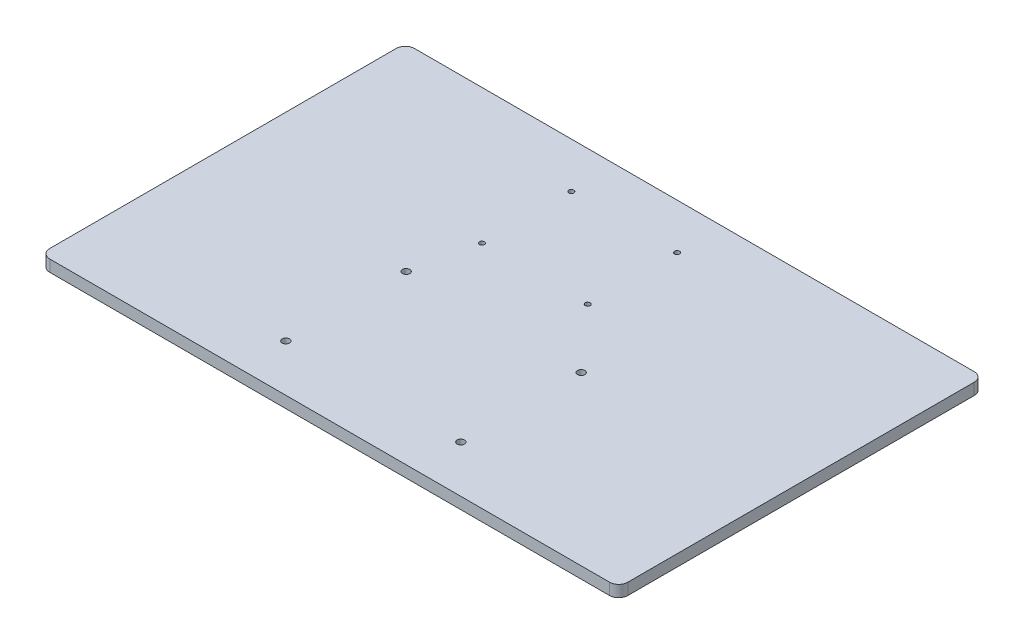
ISO-10303-21;
HEADER;
FILE_DESCRIPTION(('STEP AP214'),'2;1');
FILE_NAME('part.step','',(''),(''),'','','');
FILE_SCHEMA(('AUTOMOTIVE_DESIGN { 1 0 10303 214 1 1 1 1 }'));
ENDSEC;
DATA;
#1=APPLICATION_CONTEXT('core data for automotive mechanical design processes');
#2=APPLICATION_PROTOCOL_DEFINITION('international standard','automotive_design',2000,#1);
#3=PRODUCT_CONTEXT('',#1,'mechanical');
#4=PRODUCT('Part','Part','',(#3));
#5=PRODUCT_RELATED_PRODUCT_CATEGORY('part','',(#4));
#6=PRODUCT_DEFINITION_FORMATION('','',#4);
#7=PRODUCT_DEFINITION_CONTEXT('part definition',#1,'design');
#8=PRODUCT_DEFINITION('design','',#6,#7);
#9=PRODUCT_DEFINITION_SHAPE('','',#8);
#10=(LENGTH_UNIT() NAMED_UNIT(*) SI_UNIT(.MILLI.,.METRE.));
#11=(NAMED_UNIT(*) PLANE_ANGLE_UNIT() SI_UNIT($,.RADIAN.));
#12=(NAMED_UNIT(*) SI_UNIT($,.STERADIAN.) SOLID_ANGLE_UNIT());
#13=UNCERTAINTY_MEASURE_WITH_UNIT(LENGTH_MEASURE(1.E-05),#10,'distance_accuracy_value','');
#14=(GEOMETRIC_REPRESENTATION_CONTEXT(3) GLOBAL_UNCERTAINTY_ASSIGNED_CONTEXT((#13)) GLOBAL_UNIT_ASSIGNED_CONTEXT((#10,
#11,#12)) REPRESENTATION_CONTEXT('',''));
#15=CARTESIAN_POINT('',(0.,0.,0.));
#16=DIRECTION('',(0.,0.,1.));
#17=DIRECTION('',(1.,0.,0.));
#18=AXIS2_PLACEMENT_3D('',#15,#16,#17);
#19=CARTESIAN_POINT('',(158.5,-6.35,-100.));
#20=DIRECTION('',(1.,0.,0.));
#21=DIRECTION('',(0.,0.,-1.));
#22=AXIS2_PLACEMENT_3D('',#19,#20,#21);
#23=PLANE('',#22);
#24=DIRECTION('',(0.,0.,-1.));
#25=VECTOR('',#24,1.);
#26=CARTESIAN_POINT('',(158.5,0.,-100.));
#27=LINE('',#26,#25);
#28=CARTESIAN_POINT('',(158.5,0.,95.));
#29=VERTEX_POINT('',#28);
#30=CARTESIAN_POINT('',(158.5,0.,-95.));
#31=VERTEX_POINT('',#30);
#32=EDGE_CURVE('E158',#29,#31,#27,.T.);
#33=ORIENTED_EDGE('',*,*,#32,.F.);
#34=DIRECTION('',(0.,1.,0.));
#35=VECTOR('',#34,1.);
#36=CARTESIAN_POINT('',(158.5,-6.35,95.));
#37=LINE('',#36,#35);
#38=CARTESIAN_POINT('',(158.5,-6.35,95.));
#39=VERTEX_POINT('',#38);
#40=EDGE_CURVE('E147',#29,#39,#37,.F.);
#41=ORIENTED_EDGE('',*,*,#40,.T.);
#42=DIRECTION('',(0.,0.,-1.));
#43=VECTOR('',#42,1.);
#44=CARTESIAN_POINT('',(158.5,-6.35,-100.));
#45=LINE('',#44,#43);
#46=CARTESIAN_POINT('',(158.5,-6.35,-95.));
#47=VERTEX_POINT('',#46);
#48=EDGE_CURVE('E151',#39,#47,#45,.T.);
#49=ORIENTED_EDGE('',*,*,#48,.T.);
#50=DIRECTION('',(0.,1.,0.));
#51=VECTOR('',#50,1.);
#52=CARTESIAN_POINT('',(158.5,-6.35,-95.));
#53=LINE('',#52,#51);
#54=EDGE_CURVE('E144',#47,#31,#53,.T.);
#55=ORIENTED_EDGE('',*,*,#54,.T.);
#56=EDGE_LOOP('',(#33,#41,#49,#55));
#57=FACE_BOUND('',#56,.T.);
#58=ADVANCED_FACE('F34',(#57),#23,.T.);
#59=CARTESIAN_POINT('',(-158.5,-6.35,100.));
#60=DIRECTION('',(0.,0.,1.));
#61=DIRECTION('',(1.,0.,0.));
#62=AXIS2_PLACEMENT_3D('',#59,#60,#61);
#63=PLANE('',#62);
#64=DIRECTION('',(1.,0.,0.));
#65=VECTOR('',#64,1.);
#66=CARTESIAN_POINT('',(-158.5,0.,100.));
#67=LINE('',#66,#65);
#68=CARTESIAN_POINT('',(-153.5,0.,100.));
#69=VERTEX_POINT('',#68);
#70=CARTESIAN_POINT('',(153.5,0.,100.));
#71=VERTEX_POINT('',#70);
#72=EDGE_CURVE('E117',#69,#71,#67,.T.);
#73=ORIENTED_EDGE('',*,*,#72,.F.);
#74=DIRECTION('',(0.,1.,0.));
#75=VECTOR('',#74,1.);
#76=CARTESIAN_POINT('',(-153.5,-6.35,100.));
#77=LINE('',#76,#75);
#78=CARTESIAN_POINT('',(-153.5,-6.35,100.));
#79=VERTEX_POINT('',#78);
#80=EDGE_CURVE('E135',#69,#79,#77,.F.);
#81=ORIENTED_EDGE('',*,*,#80,.T.);
#82=DIRECTION('',(1.,0.,0.));
#83=VECTOR('',#82,1.);
#84=CARTESIAN_POINT('',(-158.5,-6.35,100.));
#85=LINE('',#84,#83);
#86=CARTESIAN_POINT('',(153.5,-6.35,100.));
#87=VERTEX_POINT('',#86);
#88=EDGE_CURVE('E119',#79,#87,#85,.T.);
#89=ORIENTED_EDGE('',*,*,#88,.T.);
#90=DIRECTION('',(0.,1.,0.));
#91=VECTOR('',#90,1.);
#92=CARTESIAN_POINT('',(153.5,-6.35,100.));
#93=LINE('',#92,#91);
#94=EDGE_CURVE('E132',#87,#71,#93,.T.);
#95=ORIENTED_EDGE('',*,*,#94,.T.);
#96=EDGE_LOOP('',(#73,#81,#89,#95));
#97=FACE_BOUND('',#96,.T.);
#98=ADVANCED_FACE('F247',(#97),#63,.T.);
#99=CARTESIAN_POINT('',(-158.5,-6.35,-100.));
#100=DIRECTION('',(-1.,0.,0.));
#101=DIRECTION('',(0.,0.,1.));
#102=AXIS2_PLACEMENT_3D('',#99,#100,#101);
#103=PLANE('',#102);
#104=DIRECTION('',(0.,0.,1.));
#105=VECTOR('',#104,1.);
#106=CARTESIAN_POINT('',(-158.5,-6.35,-100.));
#107=LINE('',#106,#105);
#108=CARTESIAN_POINT('',(-158.5,-6.35,-95.));
#109=VERTEX_POINT('',#108);
#110=CARTESIAN_POINT('',(-158.5,-6.35,95.));
#111=VERTEX_POINT('',#110);
#112=EDGE_CURVE('E123',#109,#111,#107,.T.);
#113=ORIENTED_EDGE('',*,*,#112,.T.);
#114=DIRECTION('',(0.,1.,0.));
#115=VECTOR('',#114,1.);
#116=CARTESIAN_POINT('',(-158.5,-6.35,95.));
#117=LINE('',#116,#115);
#118=CARTESIAN_POINT('',(-158.5,0.,95.));
#119=VERTEX_POINT('',#118);
#120=EDGE_CURVE('E109',#111,#119,#117,.T.);
#121=ORIENTED_EDGE('',*,*,#120,.T.);
#122=DIRECTION('',(0.,0.,1.));
#123=VECTOR('',#122,1.);
#124=CARTESIAN_POINT('',(-158.5,0.,-100.));
#125=LINE('',#124,#123);
#126=CARTESIAN_POINT('',(-158.5,0.,-95.));
#127=VERTEX_POINT('',#126);
#128=EDGE_CURVE('E102',#127,#119,#125,.T.);
#129=ORIENTED_EDGE('',*,*,#128,.F.);
#130=DIRECTION('',(0.,1.,0.));
#131=VECTOR('',#130,1.);
#132=CARTESIAN_POINT('',(-158.5,-6.35,-95.));
#133=LINE('',#132,#131);
#134=EDGE_CURVE('E115',#127,#109,#133,.F.);
#135=ORIENTED_EDGE('',*,*,#134,.T.);
#136=EDGE_LOOP('',(#113,#121,#129,#135));
#137=FACE_BOUND('',#136,.T.);
#138=ADVANCED_FACE('F114',(#137),#103,.T.);
#139=CARTESIAN_POINT('',(-158.5,-6.35,-100.));
#140=DIRECTION('',(0.,0.,-1.));
#141=DIRECTION('',(-1.,0.,0.));
#142=AXIS2_PLACEMENT_3D('',#139,#140,#141);
#143=PLANE('',#142);
#144=DIRECTION('',(-1.,0.,0.));
#145=VECTOR('',#144,1.);
#146=CARTESIAN_POINT('',(-158.5,0.,-100.));
#147=LINE('',#146,#145);
#148=CARTESIAN_POINT('',(153.5,0.,-100.));
#149=VERTEX_POINT('',#148);
#150=CARTESIAN_POINT('',(-153.5,0.,-100.));
#151=VERTEX_POINT('',#150);
#152=EDGE_CURVE('E103',#149,#151,#147,.T.);
#153=ORIENTED_EDGE('',*,*,#152,.F.);
#154=DIRECTION('',(0.,1.,0.));
#155=VECTOR('',#154,1.);
#156=CARTESIAN_POINT('',(153.5,-6.35,-100.));
#157=LINE('',#156,#155);
#158=CARTESIAN_POINT('',(153.5,-6.35,-100.));
#159=VERTEX_POINT('',#158);
#160=EDGE_CURVE('E11',#149,#159,#157,.F.);
#161=ORIENTED_EDGE('',*,*,#160,.T.);
#162=DIRECTION('',(-1.,0.,0.));
#163=VECTOR('',#162,1.);
#164=CARTESIAN_POINT('',(-158.5,-6.35,-100.));
#165=LINE('',#164,#163);
#166=CARTESIAN_POINT('',(-153.5,-6.35,-100.));
#167=VERTEX_POINT('',#166);
#168=EDGE_CURVE('E149',#159,#167,#165,.T.);
#169=ORIENTED_EDGE('',*,*,#168,.T.);
#170=DIRECTION('',(0.,1.,0.));
#171=VECTOR('',#170,1.);
#172=CARTESIAN_POINT('',(-153.5,-6.35,-100.));
#173=LINE('',#172,#171);
#174=EDGE_CURVE('E42',#167,#151,#173,.T.);
#175=ORIENTED_EDGE('',*,*,#174,.T.);
#176=EDGE_LOOP('',(#153,#161,#169,#175));
#177=FACE_BOUND('',#176,.T.);
#178=ADVANCED_FACE('F148',(#177),#143,.T.);
#179=CARTESIAN_POINT('',(0.,-6.35,0.));
#180=DIRECTION('',(0.,1.,0.));
#181=DIRECTION('',(0.,0.,1.));
#182=AXIS2_PLACEMENT_3D('',#179,#180,#181);
#183=PLANE('',#182);
#184=CARTESIAN_POINT('',(15.4853417142946,-6.35,-75.0318223737581));
#185=DIRECTION('',(0.,1.,0.));
#186=DIRECTION('',(0.,0.,1.));
#187=AXIS2_PLACEMENT_3D('',#184,#185,#186);
#188=CIRCLE('',#187,1.37499999999999);
#189=CARTESIAN_POINT('',(15.4853417142946,-6.35,-73.6568223737581));
#190=VERTEX_POINT('',#189);
#191=EDGE_CURVE('E161',#190,#190,#188,.T.);
#192=ORIENTED_EDGE('',*,*,#191,.T.);
#193=EDGE_LOOP('',(#192));
#194=FACE_BOUND('',#193,.T.);
#195=CARTESIAN_POINT('',(-49.8526210183535,-6.35,74.2010350791241));
#196=DIRECTION('',(0.,1.,0.));
#197=DIRECTION('',(0.,0.,1.));
#198=AXIS2_PLACEMENT_3D('',#195,#196,#197);
#199=CIRCLE('',#198,2.);
#200=CARTESIAN_POINT('',(-49.8526210183535,-6.35,76.2010350791241));
#201=VERTEX_POINT('',#200);
#202=EDGE_CURVE('E164',#201,#201,#199,.T.);
#203=ORIENTED_EDGE('',*,*,#202,.T.);
#204=EDGE_LOOP('',(#203));
#205=FACE_BOUND('',#204,.T.);
#206=CARTESIAN_POINT('',(-49.8526210183536,-6.35,8.20103507912406));
#207=DIRECTION('',(0.,1.,0.));
#208=DIRECTION('',(0.,0.,1.));
#209=AXIS2_PLACEMENT_3D('',#206,#207,#208);
#210=CIRCLE('',#209,2.);
#211=CARTESIAN_POINT('',(-49.8526210183536,-6.35,10.2010350791241));
#212=VERTEX_POINT('',#211);
#213=EDGE_CURVE('E168',#212,#212,#210,.T.);
#214=ORIENTED_EDGE('',*,*,#213,.T.);
#215=EDGE_LOOP('',(#214));
#216=FACE_BOUND('',#215,.T.);
#217=CARTESIAN_POINT('',(46.1473789816465,-6.35,74.201035079124));
#218=DIRECTION('',(0.,1.,0.));
#219=DIRECTION('',(0.,0.,1.));
#220=AXIS2_PLACEMENT_3D('',#217,#218,#219);
#221=CIRCLE('',#220,2.);
#222=CARTESIAN_POINT('',(46.1473789816465,-6.35,76.201035079124));
#223=VERTEX_POINT('',#222);
#224=EDGE_CURVE('E173',#223,#223,#221,.T.);
#225=ORIENTED_EDGE('',*,*,#224,.T.);
#226=EDGE_LOOP('',(#225));
#227=FACE_BOUND('',#226,.T.);
#228=CARTESIAN_POINT('',(15.4853417142937,-6.35,-26.0318223737581));
#229=DIRECTION('',(0.,1.,0.));
#230=DIRECTION('',(0.,0.,1.));
#231=AXIS2_PLACEMENT_3D('',#228,#229,#230);
#232=CIRCLE('',#231,1.37499999999999);
#233=CARTESIAN_POINT('',(15.4853417142937,-6.35,-24.6568223737581));
#234=VERTEX_POINT('',#233);
#235=EDGE_CURVE('E176',#234,#234,#232,.T.);
#236=ORIENTED_EDGE('',*,*,#235,.T.);
#237=EDGE_LOOP('',(#236));
#238=FACE_BOUND('',#237,.T.);
#239=CARTESIAN_POINT('',(-42.5146582857063,-6.35,-26.0318223737591));
#240=DIRECTION('',(0.,1.,0.));
#241=DIRECTION('',(0.,0.,1.));
#242=AXIS2_PLACEMENT_3D('',#239,#240,#241);
#243=CIRCLE('',#242,1.37499999999999);
#244=CARTESIAN_POINT('',(-42.5146582857063,-6.35,-24.6568223737591));
#245=VERTEX_POINT('',#244);
#246=EDGE_CURVE('E179',#245,#245,#243,.T.);
#247=ORIENTED_EDGE('',*,*,#246,.T.);
#248=EDGE_LOOP('',(#247));
#249=FACE_BOUND('',#248,.T.);
#250=CARTESIAN_POINT('',(-42.5146582857054,-6.35,-75.0318223737591));
#251=DIRECTION('',(0.,1.,0.));
#252=DIRECTION('',(0.,0.,1.));
#253=AXIS2_PLACEMENT_3D('',#250,#251,#252);
#254=CIRCLE('',#253,1.37500000000002);
#255=CARTESIAN_POINT('',(-42.5146582857054,-6.35,-73.656822373759));
#256=VERTEX_POINT('',#255);
#257=EDGE_CURVE('E182',#256,#256,#254,.T.);
#258=ORIENTED_EDGE('',*,*,#257,.T.);
#259=EDGE_LOOP('',(#258));
#260=FACE_BOUND('',#259,.T.);
#261=CARTESIAN_POINT('',(46.1473789816464,-6.35,8.20103507912398));
#262=DIRECTION('',(0.,1.,0.));
#263=DIRECTION('',(0.,0.,1.));
#264=AXIS2_PLACEMENT_3D('',#261,#262,#263);
#265=CIRCLE('',#264,2.);
#266=CARTESIAN_POINT('',(46.1473789816464,-6.35,10.201035079124));
#267=VERTEX_POINT('',#266);
#268=EDGE_CURVE('E185',#267,#267,#265,.T.);
#269=ORIENTED_EDGE('',*,*,#268,.T.);
#270=EDGE_LOOP('',(#269));
#271=FACE_BOUND('',#270,.T.);
#272=ORIENTED_EDGE('',*,*,#88,.F.);
#273=CARTESIAN_POINT('',(-153.5,-6.35,95.));
#274=DIRECTION('',(0.,1.,0.));
#275=DIRECTION('',(0.,0.,1.));
#276=AXIS2_PLACEMENT_3D('',#273,#274,#275);
#277=CIRCLE('',#276,5.);
#278=EDGE_CURVE('E142',#79,#111,#277,.F.);
#279=ORIENTED_EDGE('',*,*,#278,.T.);
#280=ORIENTED_EDGE('',*,*,#112,.F.);
#281=CARTESIAN_POINT('',(-153.5,-6.35,-95.));
#282=DIRECTION('',(0.,1.,0.));
#283=DIRECTION('',(0.,0.,1.));
#284=AXIS2_PLACEMENT_3D('',#281,#282,#283);
#285=CIRCLE('',#284,5.);
#286=EDGE_CURVE('E49',#109,#167,#285,.F.);
#287=ORIENTED_EDGE('',*,*,#286,.T.);
#288=ORIENTED_EDGE('',*,*,#168,.F.);
#289=CARTESIAN_POINT('',(153.5,-6.35,-95.));
#290=DIRECTION('',(0.,1.,0.));
#291=DIRECTION('',(0.,0.,1.));
#292=AXIS2_PLACEMENT_3D('',#289,#290,#291);
#293=CIRCLE('',#292,5.);
#294=EDGE_CURVE('E138',#159,#47,#293,.F.);
#295=ORIENTED_EDGE('',*,*,#294,.T.);
#296=ORIENTED_EDGE('',*,*,#48,.F.);
#297=CARTESIAN_POINT('',(153.5,-6.35,95.));
#298=DIRECTION('',(0.,1.,0.));
#299=DIRECTION('',(0.,0.,1.));
#300=AXIS2_PLACEMENT_3D('',#297,#298,#299);
#301=CIRCLE('',#300,5.);
#302=EDGE_CURVE('E140',#39,#87,#301,.F.);
#303=ORIENTED_EDGE('',*,*,#302,.T.);
#304=EDGE_LOOP('',(#272,#279,#280,#287,#288,#295,#296,#303));
#305=FACE_BOUND('',#304,.T.);
#306=ADVANCED_FACE('F219',(#194,#205,#216,#227,#238,#249,#260,#271,#305),#183,.F.);
#307=CARTESIAN_POINT('',(0.,0.,0.));
#308=DIRECTION('',(0.,1.,0.));
#309=DIRECTION('',(0.,0.,1.));
#310=AXIS2_PLACEMENT_3D('',#307,#308,#309);
#311=PLANE('',#310);
#312=CARTESIAN_POINT('',(15.4853417142946,0.,-75.0318223737581));
#313=DIRECTION('',(0.,1.,0.));
#314=DIRECTION('',(0.,0.,1.));
#315=AXIS2_PLACEMENT_3D('',#312,#313,#314);
#316=CIRCLE('',#315,1.37499999999999);
#317=CARTESIAN_POINT('',(15.4853417142946,0.,-73.6568223737581));
#318=VERTEX_POINT('',#317);
#319=EDGE_CURVE('E198',#318,#318,#316,.T.);
#320=ORIENTED_EDGE('',*,*,#319,.F.);
#321=EDGE_LOOP('',(#320));
#322=FACE_BOUND('',#321,.T.);
#323=CARTESIAN_POINT('',(-49.8526210183535,0.,74.2010350791241));
#324=DIRECTION('',(0.,1.,0.));
#325=DIRECTION('',(0.,0.,1.));
#326=AXIS2_PLACEMENT_3D('',#323,#324,#325);
#327=CIRCLE('',#326,2.);
#328=CARTESIAN_POINT('',(-49.8526210183535,0.,76.2010350791241));
#329=VERTEX_POINT('',#328);
#330=EDGE_CURVE('E195',#329,#329,#327,.T.);
#331=ORIENTED_EDGE('',*,*,#330,.F.);
#332=EDGE_LOOP('',(#331));
#333=FACE_BOUND('',#332,.T.);
#334=CARTESIAN_POINT('',(-49.8526210183536,0.,8.20103507912406));
#335=DIRECTION('',(0.,1.,0.));
#336=DIRECTION('',(0.,0.,1.));
#337=AXIS2_PLACEMENT_3D('',#334,#335,#336);
#338=CIRCLE('',#337,2.);
#339=CARTESIAN_POINT('',(-49.8526210183536,0.,10.2010350791241));
#340=VERTEX_POINT('',#339);
#341=EDGE_CURVE('E192',#340,#340,#338,.T.);
#342=ORIENTED_EDGE('',*,*,#341,.F.);
#343=EDGE_LOOP('',(#342));
#344=FACE_BOUND('',#343,.T.);
#345=CARTESIAN_POINT('',(46.1473789816465,0.,74.201035079124));
#346=DIRECTION('',(0.,1.,0.));
#347=DIRECTION('',(0.,0.,1.));
#348=AXIS2_PLACEMENT_3D('',#345,#346,#347);
#349=CIRCLE('',#348,2.);
#350=CARTESIAN_POINT('',(46.1473789816465,0.,76.201035079124));
#351=VERTEX_POINT('',#350);
#352=EDGE_CURVE('E191',#351,#351,#349,.T.);
#353=ORIENTED_EDGE('',*,*,#352,.F.);
#354=EDGE_LOOP('',(#353));
#355=FACE_BOUND('',#354,.T.);
#356=CARTESIAN_POINT('',(15.4853417142937,0.,-26.0318223737581));
#357=DIRECTION('',(0.,1.,0.));
#358=DIRECTION('',(0.,0.,1.));
#359=AXIS2_PLACEMENT_3D('',#356,#357,#358);
#360=CIRCLE('',#359,1.37499999999999);
#361=CARTESIAN_POINT('',(15.4853417142937,0.,-24.6568223737581));
#362=VERTEX_POINT('',#361);
#363=EDGE_CURVE('E201',#362,#362,#360,.T.);
#364=ORIENTED_EDGE('',*,*,#363,.F.);
#365=EDGE_LOOP('',(#364));
#366=FACE_BOUND('',#365,.T.);
#367=CARTESIAN_POINT('',(-42.5146582857063,0.,-26.0318223737591));
#368=DIRECTION('',(0.,1.,0.));
#369=DIRECTION('',(0.,0.,1.));
#370=AXIS2_PLACEMENT_3D('',#367,#368,#369);
#371=CIRCLE('',#370,1.37499999999999);
#372=CARTESIAN_POINT('',(-42.5146582857063,0.,-24.6568223737591));
#373=VERTEX_POINT('',#372);
#374=EDGE_CURVE('E207',#373,#373,#371,.T.);
#375=ORIENTED_EDGE('',*,*,#374,.F.);
#376=EDGE_LOOP('',(#375));
#377=FACE_BOUND('',#376,.T.);
#378=CARTESIAN_POINT('',(-42.5146582857054,0.,-75.0318223737591));
#379=DIRECTION('',(0.,1.,0.));
#380=DIRECTION('',(0.,0.,1.));
#381=AXIS2_PLACEMENT_3D('',#378,#379,#380);
#382=CIRCLE('',#381,1.37500000000002);
#383=CARTESIAN_POINT('',(-42.5146582857054,0.,-73.656822373759));
#384=VERTEX_POINT('',#383);
#385=EDGE_CURVE('E204',#384,#384,#382,.T.);
#386=ORIENTED_EDGE('',*,*,#385,.F.);
#387=EDGE_LOOP('',(#386));
#388=FACE_BOUND('',#387,.T.);
#389=CARTESIAN_POINT('',(46.1473789816464,0.,8.20103507912398));
#390=DIRECTION('',(0.,1.,0.));
#391=DIRECTION('',(0.,0.,1.));
#392=AXIS2_PLACEMENT_3D('',#389,#390,#391);
#393=CIRCLE('',#392,2.);
#394=CARTESIAN_POINT('',(46.1473789816464,0.,10.201035079124));
#395=VERTEX_POINT('',#394);
#396=EDGE_CURVE('E188',#395,#395,#393,.T.);
#397=ORIENTED_EDGE('',*,*,#396,.F.);
#398=EDGE_LOOP('',(#397));
#399=FACE_BOUND('',#398,.T.);
#400=ORIENTED_EDGE('',*,*,#128,.T.);
#401=CARTESIAN_POINT('',(-153.5,0.,95.));
#402=DIRECTION('',(0.,1.,0.));
#403=DIRECTION('',(0.,0.,1.));
#404=AXIS2_PLACEMENT_3D('',#401,#402,#403);
#405=CIRCLE('',#404,5.);
#406=EDGE_CURVE('E130',#119,#69,#405,.T.);
#407=ORIENTED_EDGE('',*,*,#406,.T.);
#408=ORIENTED_EDGE('',*,*,#72,.T.);
#409=CARTESIAN_POINT('',(153.5,0.,95.));
#410=DIRECTION('',(0.,1.,0.));
#411=DIRECTION('',(0.,0.,1.));
#412=AXIS2_PLACEMENT_3D('',#409,#410,#411);
#413=CIRCLE('',#412,5.);
#414=EDGE_CURVE('E128',#71,#29,#413,.T.);
#415=ORIENTED_EDGE('',*,*,#414,.T.);
#416=ORIENTED_EDGE('',*,*,#32,.T.);
#417=CARTESIAN_POINT('',(153.5,0.,-95.));
#418=DIRECTION('',(0.,1.,0.));
#419=DIRECTION('',(0.,0.,1.));
#420=AXIS2_PLACEMENT_3D('',#417,#418,#419);
#421=CIRCLE('',#420,5.);
#422=EDGE_CURVE('E108',#31,#149,#421,.T.);
#423=ORIENTED_EDGE('',*,*,#422,.T.);
#424=ORIENTED_EDGE('',*,*,#152,.T.);
#425=CARTESIAN_POINT('',(-153.5,0.,-95.));
#426=DIRECTION('',(0.,1.,0.));
#427=DIRECTION('',(0.,0.,1.));
#428=AXIS2_PLACEMENT_3D('',#425,#426,#427);
#429=CIRCLE('',#428,5.);
#430=EDGE_CURVE('E99',#151,#127,#429,.T.);
#431=ORIENTED_EDGE('',*,*,#430,.T.);
#432=EDGE_LOOP('',(#400,#407,#408,#415,#416,#423,#424,#431));
#433=FACE_BOUND('',#432,.T.);
#434=ADVANCED_FACE('F101',(#322,#333,#344,#355,#366,#377,#388,#399,#433),#311,.T.);
#435=CARTESIAN_POINT('',(-153.5,-6.35,95.));
#436=DIRECTION('',(0.,1.,0.));
#437=DIRECTION('',(0.,0.,1.));
#438=AXIS2_PLACEMENT_3D('',#435,#436,#437);
#439=CYLINDRICAL_SURFACE('',#438,5.);
#440=ORIENTED_EDGE('',*,*,#278,.F.);
#441=ORIENTED_EDGE('',*,*,#80,.F.);
#442=ORIENTED_EDGE('',*,*,#406,.F.);
#443=ORIENTED_EDGE('',*,*,#120,.F.);
#444=EDGE_LOOP('',(#440,#441,#442,#443));
#445=FACE_BOUND('',#444,.T.);
#446=ADVANCED_FACE('F218',(#445),#439,.T.);
#447=CARTESIAN_POINT('',(153.5,-6.35,95.));
#448=DIRECTION('',(0.,1.,0.));
#449=DIRECTION('',(0.,0.,1.));
#450=AXIS2_PLACEMENT_3D('',#447,#448,#449);
#451=CYLINDRICAL_SURFACE('',#450,5.);
#452=ORIENTED_EDGE('',*,*,#302,.F.);
#453=ORIENTED_EDGE('',*,*,#40,.F.);
#454=ORIENTED_EDGE('',*,*,#414,.F.);
#455=ORIENTED_EDGE('',*,*,#94,.F.);
#456=EDGE_LOOP('',(#452,#453,#454,#455));
#457=FACE_BOUND('',#456,.T.);
#458=ADVANCED_FACE('F249',(#457),#451,.T.);
#459=CARTESIAN_POINT('',(153.5,-6.35,-95.));
#460=DIRECTION('',(0.,1.,0.));
#461=DIRECTION('',(0.,0.,1.));
#462=AXIS2_PLACEMENT_3D('',#459,#460,#461);
#463=CYLINDRICAL_SURFACE('',#462,5.);
#464=ORIENTED_EDGE('',*,*,#294,.F.);
#465=ORIENTED_EDGE('',*,*,#160,.F.);
#466=ORIENTED_EDGE('',*,*,#422,.F.);
#467=ORIENTED_EDGE('',*,*,#54,.F.);
#468=EDGE_LOOP('',(#464,#465,#466,#467));
#469=FACE_BOUND('',#468,.T.);
#470=ADVANCED_FACE('F254',(#469),#463,.T.);
#471=CARTESIAN_POINT('',(-153.5,-6.35,-95.));
#472=DIRECTION('',(0.,1.,0.));
#473=DIRECTION('',(0.,0.,1.));
#474=AXIS2_PLACEMENT_3D('',#471,#472,#473);
#475=CYLINDRICAL_SURFACE('',#474,5.);
#476=ORIENTED_EDGE('',*,*,#286,.F.);
#477=ORIENTED_EDGE('',*,*,#134,.F.);
#478=ORIENTED_EDGE('',*,*,#430,.F.);
#479=ORIENTED_EDGE('',*,*,#174,.F.);
#480=EDGE_LOOP('',(#476,#477,#478,#479));
#481=FACE_BOUND('',#480,.T.);
#482=ADVANCED_FACE('F36',(#481),#475,.T.);
#483=CARTESIAN_POINT('',(46.1473789816464,-10.,8.20103507912398));
#484=DIRECTION('',(0.,1.,0.));
#485=DIRECTION('',(0.,0.,1.));
#486=AXIS2_PLACEMENT_3D('',#483,#484,#485);
#487=CYLINDRICAL_SURFACE('',#486,2.);
#488=ORIENTED_EDGE('',*,*,#396,.T.);
#489=EDGE_LOOP('',(#488));
#490=FACE_BOUND('',#489,.T.);
#491=ORIENTED_EDGE('',*,*,#268,.F.);
#492=EDGE_LOOP('',(#491));
#493=FACE_BOUND('',#492,.T.);
#494=ADVANCED_FACE('F228',(#490,#493),#487,.F.);
#495=CARTESIAN_POINT('',(-42.5146582857054,-10.,-75.0318223737591));
#496=DIRECTION('',(0.,1.,0.));
#497=DIRECTION('',(0.,0.,1.));
#498=AXIS2_PLACEMENT_3D('',#495,#496,#497);
#499=CYLINDRICAL_SURFACE('',#498,1.37500000000002);
#500=ORIENTED_EDGE('',*,*,#385,.T.);
#501=EDGE_LOOP('',(#500));
#502=FACE_BOUND('',#501,.T.);
#503=ORIENTED_EDGE('',*,*,#257,.F.);
#504=EDGE_LOOP('',(#503));
#505=FACE_BOUND('',#504,.T.);
#506=ADVANCED_FACE('F231',(#502,#505),#499,.F.);
#507=CARTESIAN_POINT('',(-42.5146582857063,-10.,-26.0318223737591));
#508=DIRECTION('',(0.,1.,0.));
#509=DIRECTION('',(0.,0.,1.));
#510=AXIS2_PLACEMENT_3D('',#507,#508,#509);
#511=CYLINDRICAL_SURFACE('',#510,1.37499999999999);
#512=ORIENTED_EDGE('',*,*,#374,.T.);
#513=EDGE_LOOP('',(#512));
#514=FACE_BOUND('',#513,.T.);
#515=ORIENTED_EDGE('',*,*,#246,.F.);
#516=EDGE_LOOP('',(#515));
#517=FACE_BOUND('',#516,.T.);
#518=ADVANCED_FACE('F317',(#514,#517),#511,.F.);
#519=CARTESIAN_POINT('',(15.4853417142937,-10.,-26.0318223737581));
#520=DIRECTION('',(0.,1.,0.));
#521=DIRECTION('',(0.,0.,1.));
#522=AXIS2_PLACEMENT_3D('',#519,#520,#521);
#523=CYLINDRICAL_SURFACE('',#522,1.37499999999999);
#524=ORIENTED_EDGE('',*,*,#363,.T.);
#525=EDGE_LOOP('',(#524));
#526=FACE_BOUND('',#525,.T.);
#527=ORIENTED_EDGE('',*,*,#235,.F.);
#528=EDGE_LOOP('',(#527));
#529=FACE_BOUND('',#528,.T.);
#530=ADVANCED_FACE('F213',(#526,#529),#523,.F.);
#531=CARTESIAN_POINT('',(46.1473789816465,-10.,74.201035079124));
#532=DIRECTION('',(0.,1.,0.));
#533=DIRECTION('',(0.,0.,1.));
#534=AXIS2_PLACEMENT_3D('',#531,#532,#533);
#535=CYLINDRICAL_SURFACE('',#534,2.);
#536=ORIENTED_EDGE('',*,*,#352,.T.);
#537=EDGE_LOOP('',(#536));
#538=FACE_BOUND('',#537,.T.);
#539=ORIENTED_EDGE('',*,*,#224,.F.);
#540=EDGE_LOOP('',(#539));
#541=FACE_BOUND('',#540,.T.);
#542=ADVANCED_FACE('F336',(#538,#541),#535,.F.);
#543=CARTESIAN_POINT('',(-49.8526210183536,-10.,8.20103507912406));
#544=DIRECTION('',(0.,1.,0.));
#545=DIRECTION('',(0.,0.,1.));
#546=AXIS2_PLACEMENT_3D('',#543,#544,#545);
#547=CYLINDRICAL_SURFACE('',#546,2.);
#548=ORIENTED_EDGE('',*,*,#341,.T.);
#549=EDGE_LOOP('',(#548));
#550=FACE_BOUND('',#549,.T.);
#551=ORIENTED_EDGE('',*,*,#213,.F.);
#552=EDGE_LOOP('',(#551));
#553=FACE_BOUND('',#552,.T.);
#554=ADVANCED_FACE('F345',(#550,#553),#547,.F.);
#555=CARTESIAN_POINT('',(-49.8526210183535,-10.,74.2010350791241));
#556=DIRECTION('',(0.,1.,0.));
#557=DIRECTION('',(0.,0.,1.));
#558=AXIS2_PLACEMENT_3D('',#555,#556,#557);
#559=CYLINDRICAL_SURFACE('',#558,2.);
#560=ORIENTED_EDGE('',*,*,#330,.T.);
#561=EDGE_LOOP('',(#560));
#562=FACE_BOUND('',#561,.T.);
#563=ORIENTED_EDGE('',*,*,#202,.F.);
#564=EDGE_LOOP('',(#563));
#565=FACE_BOUND('',#564,.T.);
#566=ADVANCED_FACE('F355',(#562,#565),#559,.F.);
#567=CARTESIAN_POINT('',(15.4853417142946,-10.,-75.0318223737581));
#568=DIRECTION('',(0.,1.,0.));
#569=DIRECTION('',(0.,0.,1.));
#570=AXIS2_PLACEMENT_3D('',#567,#568,#569);
#571=CYLINDRICAL_SURFACE('',#570,1.37499999999999);
#572=ORIENTED_EDGE('',*,*,#319,.T.);
#573=EDGE_LOOP('',(#572));
#574=FACE_BOUND('',#573,.T.);
#575=ORIENTED_EDGE('',*,*,#191,.F.);
#576=EDGE_LOOP('',(#575));
#577=FACE_BOUND('',#576,.T.);
#578=ADVANCED_FACE('F365',(#574,#577),#571,.F.);
#579=CLOSED_SHELL('',(#58,#98,#138,#178,#306,#434,#446,#458,#470,#482,#494,#506,#518,#530,#542,
#554,#566,#578));
#580=MANIFOLD_SOLID_BREP('B2',#579);
#581=ADVANCED_BREP_SHAPE_REPRESENTATION('',(#18,#580),#14);
#582=SHAPE_DEFINITION_REPRESENTATION(#9,#581);
ENDSEC;
END-ISO-10303-21;
